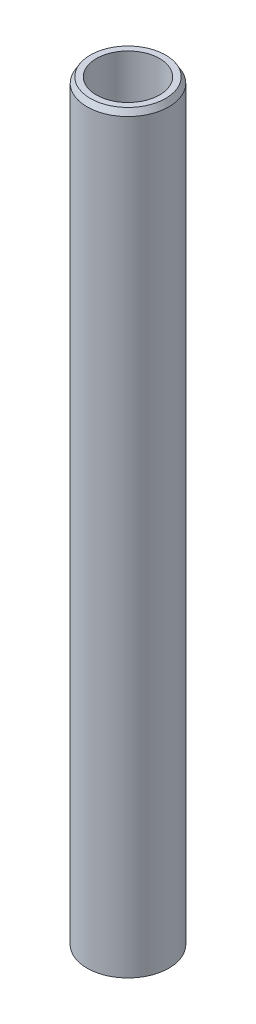
ISO-10303-21;
HEADER;
FILE_DESCRIPTION(('STEP AP214'),'2;1');
FILE_NAME('part.step','',(''),(''),'','','');
FILE_SCHEMA(('AUTOMOTIVE_DESIGN { 1 0 10303 214 1 1 1 1 }'));
ENDSEC;
DATA;
#1=APPLICATION_CONTEXT('core data for automotive mechanical design processes');
#2=APPLICATION_PROTOCOL_DEFINITION('international standard','automotive_design',2000,#1);
#3=PRODUCT_CONTEXT('',#1,'mechanical');
#4=PRODUCT('Part','Part','',(#3));
#5=PRODUCT_RELATED_PRODUCT_CATEGORY('part','',(#4));
#6=PRODUCT_DEFINITION_FORMATION('','',#4);
#7=PRODUCT_DEFINITION_CONTEXT('part definition',#1,'design');
#8=PRODUCT_DEFINITION('design','',#6,#7);
#9=PRODUCT_DEFINITION_SHAPE('','',#8);
#10=(LENGTH_UNIT() NAMED_UNIT(*) SI_UNIT(.MILLI.,.METRE.));
#11=(NAMED_UNIT(*) PLANE_ANGLE_UNIT() SI_UNIT($,.RADIAN.));
#12=(NAMED_UNIT(*) SI_UNIT($,.STERADIAN.) SOLID_ANGLE_UNIT());
#13=UNCERTAINTY_MEASURE_WITH_UNIT(LENGTH_MEASURE(1.E-05),#10,'distance_accuracy_value','');
#14=(GEOMETRIC_REPRESENTATION_CONTEXT(3) GLOBAL_UNCERTAINTY_ASSIGNED_CONTEXT((#13)) GLOBAL_UNIT_ASSIGNED_CONTEXT((#10,
#11,#12)) REPRESENTATION_CONTEXT('',''));
#15=CARTESIAN_POINT('',(0.,0.,0.));
#16=DIRECTION('',(0.,0.,1.));
#17=DIRECTION('',(1.,0.,0.));
#18=AXIS2_PLACEMENT_3D('',#15,#16,#17);
#19=CARTESIAN_POINT('',(0.,600.,0.));
#20=DIRECTION('',(0.,-1.,0.));
#21=DIRECTION('',(0.,0.,-1.));
#22=AXIS2_PLACEMENT_3D('',#19,#20,#21);
#23=CYLINDRICAL_SURFACE('',#22,32.5);
#24=CARTESIAN_POINT('',(0.,595.532284417092,0.));
#25=DIRECTION('',(0.,1.,0.));
#26=DIRECTION('',(0.,0.,1.));
#27=AXIS2_PLACEMENT_3D('',#24,#25,#26);
#28=CIRCLE('',#27,32.5);
#29=CARTESIAN_POINT('',(0.,595.532284417092,32.5));
#30=VERTEX_POINT('',#29);
#31=EDGE_CURVE('E50',#30,#30,#28,.F.);
#32=ORIENTED_EDGE('',*,*,#31,.T.);
#33=EDGE_LOOP('',(#32));
#34=FACE_BOUND('',#33,.T.);
#35=CARTESIAN_POINT('',(0.,2.57943679445427,0.));
#36=DIRECTION('',(0.,1.,0.));
#37=DIRECTION('',(0.,0.,1.));
#38=AXIS2_PLACEMENT_3D('',#35,#36,#37);
#39=CIRCLE('',#38,32.5);
#40=CARTESIAN_POINT('',(0.,2.57943679445427,32.5));
#41=VERTEX_POINT('',#40);
#42=EDGE_CURVE('E51',#41,#41,#39,.T.);
#43=ORIENTED_EDGE('',*,*,#42,.T.);
#44=EDGE_LOOP('',(#43));
#45=FACE_BOUND('',#44,.T.);
#46=ADVANCED_FACE('F39',(#34,#45),#23,.T.);
#47=CARTESIAN_POINT('',(0.,600.,0.));
#48=DIRECTION('',(0.,1.,0.));
#49=DIRECTION('',(0.,0.,1.));
#50=AXIS2_PLACEMENT_3D('',#47,#48,#49);
#51=PLANE('',#50);
#52=CARTESIAN_POINT('',(0.,600.,0.));
#53=DIRECTION('',(0.,1.,0.));
#54=DIRECTION('',(0.,0.,1.));
#55=AXIS2_PLACEMENT_3D('',#52,#53,#54);
#56=CIRCLE('',#55,29.9205632055455);
#57=CARTESIAN_POINT('',(0.,600.,29.9205632055455));
#58=VERTEX_POINT('',#57);
#59=EDGE_CURVE('E54',#58,#58,#56,.T.);
#60=ORIENTED_EDGE('',*,*,#59,.T.);
#61=EDGE_LOOP('',(#60));
#62=FACE_BOUND('',#61,.T.);
#63=CARTESIAN_POINT('',(0.,600.,0.));
#64=DIRECTION('',(0.,1.,0.));
#65=DIRECTION('',(0.,0.,1.));
#66=AXIS2_PLACEMENT_3D('',#63,#64,#65);
#67=CIRCLE('',#66,25.133851199875);
#68=CARTESIAN_POINT('',(0.,600.,25.133851199875));
#69=VERTEX_POINT('',#68);
#70=EDGE_CURVE('E58',#69,#69,#67,.T.);
#71=ORIENTED_EDGE('',*,*,#70,.F.);
#72=EDGE_LOOP('',(#71));
#73=FACE_BOUND('',#72,.T.);
#74=ADVANCED_FACE('F69',(#62,#73),#51,.T.);
#75=CARTESIAN_POINT('',(0.,0.,0.));
#76=DIRECTION('',(0.,1.,0.));
#77=DIRECTION('',(0.,0.,1.));
#78=AXIS2_PLACEMENT_3D('',#75,#76,#77);
#79=PLANE('',#78);
#80=CARTESIAN_POINT('',(0.,0.,0.));
#81=DIRECTION('',(0.,1.,0.));
#82=DIRECTION('',(0.,0.,1.));
#83=AXIS2_PLACEMENT_3D('',#80,#81,#82);
#84=CIRCLE('',#83,28.0322844170925);
#85=CARTESIAN_POINT('',(0.,0.,28.0322844170925));
#86=VERTEX_POINT('',#85);
#87=EDGE_CURVE('E10',#86,#86,#84,.F.);
#88=ORIENTED_EDGE('',*,*,#87,.T.);
#89=EDGE_LOOP('',(#88));
#90=FACE_BOUND('',#89,.T.);
#91=CARTESIAN_POINT('',(0.,0.,0.));
#92=DIRECTION('',(0.,1.,0.));
#93=DIRECTION('',(0.,0.,1.));
#94=AXIS2_PLACEMENT_3D('',#91,#92,#93);
#95=CIRCLE('',#94,25.133851199875);
#96=CARTESIAN_POINT('',(0.,0.,25.133851199875));
#97=VERTEX_POINT('',#96);
#98=EDGE_CURVE('E63',#97,#97,#95,.T.);
#99=ORIENTED_EDGE('',*,*,#98,.T.);
#100=EDGE_LOOP('',(#99));
#101=FACE_BOUND('',#100,.T.);
#102=ADVANCED_FACE('F75',(#90,#101),#79,.F.);
#103=CARTESIAN_POINT('',(0.,600.,0.));
#104=DIRECTION('',(0.,-1.,0.));
#105=DIRECTION('',(0.,0.,-1.));
#106=AXIS2_PLACEMENT_3D('',#103,#104,#105);
#107=CYLINDRICAL_SURFACE('',#106,25.133851199875);
#108=ORIENTED_EDGE('',*,*,#70,.T.);
#109=EDGE_LOOP('',(#108));
#110=FACE_BOUND('',#109,.T.);
#111=ORIENTED_EDGE('',*,*,#98,.F.);
#112=EDGE_LOOP('',(#111));
#113=FACE_BOUND('',#112,.T.);
#114=ADVANCED_FACE('F70',(#110,#113),#107,.F.);
#115=CARTESIAN_POINT('',(0.,600.,0.));
#116=DIRECTION('',(0.,-1.,0.));
#117=DIRECTION('',(0.,0.,-1.));
#118=AXIS2_PLACEMENT_3D('',#115,#116,#117);
#119=CONICAL_SURFACE('',#118,29.9205632055455,0.523598775598301);
#120=ORIENTED_EDGE('',*,*,#31,.F.);
#121=EDGE_LOOP('',(#120));
#122=FACE_BOUND('',#121,.T.);
#123=ORIENTED_EDGE('',*,*,#59,.F.);
#124=EDGE_LOOP('',(#123));
#125=FACE_BOUND('',#124,.T.);
#126=ADVANCED_FACE('F81',(#122,#125),#119,.T.);
#127=CARTESIAN_POINT('',(0.,2.57943679445427,0.));
#128=DIRECTION('',(0.,1.,0.));
#129=DIRECTION('',(0.,0.,1.));
#130=AXIS2_PLACEMENT_3D('',#127,#128,#129);
#131=CONICAL_SURFACE('',#130,32.5,1.0471975511966);
#132=ORIENTED_EDGE('',*,*,#87,.F.);
#133=EDGE_LOOP('',(#132));
#134=FACE_BOUND('',#133,.T.);
#135=ORIENTED_EDGE('',*,*,#42,.F.);
#136=EDGE_LOOP('',(#135));
#137=FACE_BOUND('',#136,.T.);
#138=ADVANCED_FACE('F45',(#134,#137),#131,.T.);
#139=CLOSED_SHELL('',(#46,#74,#102,#114,#126,#138));
#140=MANIFOLD_SOLID_BREP('B2',#139);
#141=ADVANCED_BREP_SHAPE_REPRESENTATION('',(#18,#140),#14);
#142=SHAPE_DEFINITION_REPRESENTATION(#9,#141);
ENDSEC;
END-ISO-10303-21;
